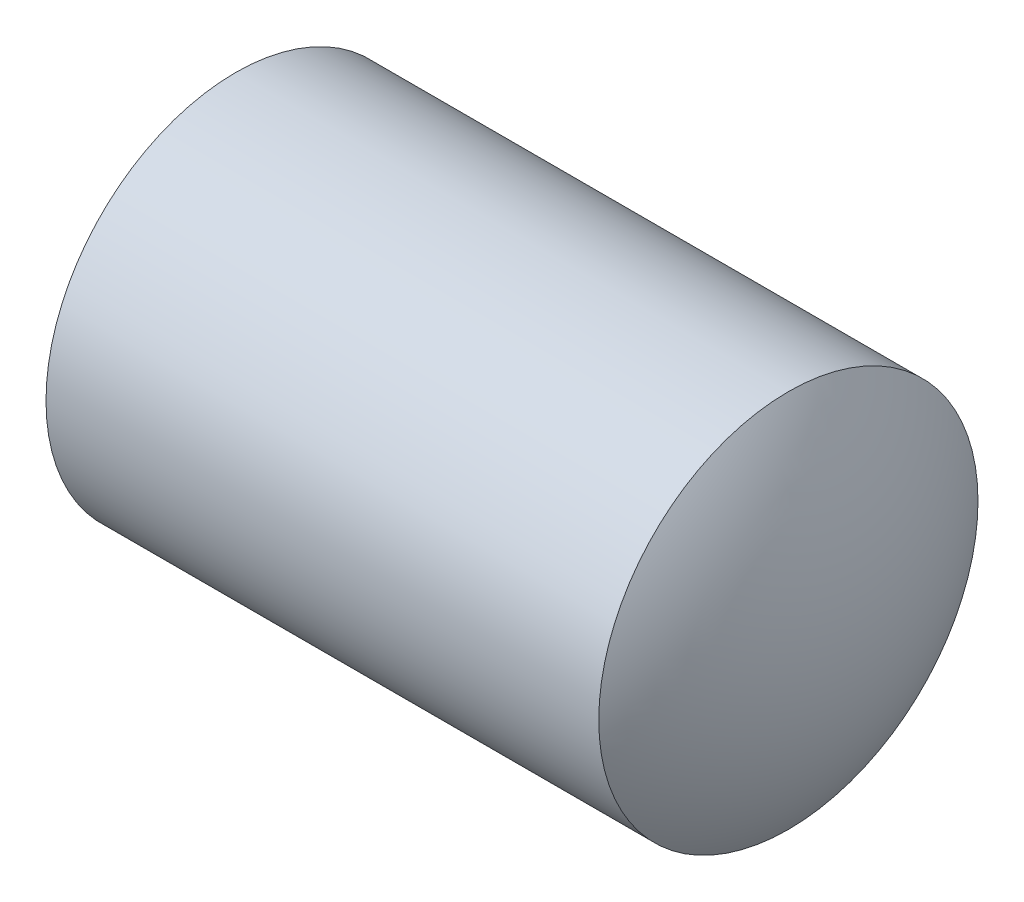
ISO-10303-21;
HEADER;
FILE_DESCRIPTION(('STEP AP214'),'2;1');
FILE_NAME('part.step','',(''),(''),'','','');
FILE_SCHEMA(('AUTOMOTIVE_DESIGN { 1 0 10303 214 1 1 1 1 }'));
ENDSEC;
DATA;
#1=APPLICATION_CONTEXT('core data for automotive mechanical design processes');
#2=APPLICATION_PROTOCOL_DEFINITION('international standard','automotive_design',2000,#1);
#3=PRODUCT_CONTEXT('',#1,'mechanical');
#4=PRODUCT('Part','Part','',(#3));
#5=PRODUCT_RELATED_PRODUCT_CATEGORY('part','',(#4));
#6=PRODUCT_DEFINITION_FORMATION('','',#4);
#7=PRODUCT_DEFINITION_CONTEXT('part definition',#1,'design');
#8=PRODUCT_DEFINITION('design','',#6,#7);
#9=PRODUCT_DEFINITION_SHAPE('','',#8);
#10=(LENGTH_UNIT() NAMED_UNIT(*) SI_UNIT(.MILLI.,.METRE.));
#11=(NAMED_UNIT(*) PLANE_ANGLE_UNIT() SI_UNIT($,.RADIAN.));
#12=(NAMED_UNIT(*) SI_UNIT($,.STERADIAN.) SOLID_ANGLE_UNIT());
#13=UNCERTAINTY_MEASURE_WITH_UNIT(LENGTH_MEASURE(1.E-05),#10,'distance_accuracy_value','');
#14=(GEOMETRIC_REPRESENTATION_CONTEXT(3) GLOBAL_UNCERTAINTY_ASSIGNED_CONTEXT((#13)) GLOBAL_UNIT_ASSIGNED_CONTEXT((#10,
#11,#12)) REPRESENTATION_CONTEXT('',''));
#15=CARTESIAN_POINT('',(0.,0.,0.));
#16=DIRECTION('',(0.,0.,1.));
#17=DIRECTION('',(1.,0.,0.));
#18=AXIS2_PLACEMENT_3D('',#15,#16,#17);
#19=CARTESIAN_POINT('',(0.,0.,0.));
#20=DIRECTION('',(-1.,0.,0.));
#21=DIRECTION('',(0.,0.,1.));
#22=AXIS2_PLACEMENT_3D('',#19,#20,#21);
#23=PLANE('',#22);
#24=CARTESIAN_POINT('',(0.,0.,0.));
#25=DIRECTION('',(-1.,0.,0.));
#26=DIRECTION('',(0.,0.,1.));
#27=AXIS2_PLACEMENT_3D('',#24,#25,#26);
#28=CIRCLE('',#27,1.2195);
#29=CARTESIAN_POINT('',(0.,0.,1.2195));
#30=VERTEX_POINT('',#29);
#31=EDGE_CURVE('E137',#30,#30,#28,.T.);
#32=ORIENTED_EDGE('',*,*,#31,.T.);
#33=EDGE_LOOP('',(#32));
#34=FACE_BOUND('',#33,.T.);
#35=DIRECTION('',(0.,0.,-1.));
#36=VECTOR('',#35,1.);
#37=CARTESIAN_POINT('',(0.,0.750000000000004,0.43301270189222));
#38=LINE('',#37,#36);
#39=CARTESIAN_POINT('',(0.,0.750000000000004,0.43301270189222));
#40=VERTEX_POINT('',#39);
#41=CARTESIAN_POINT('',(0.,0.750000000000003,-0.433012701892218));
#42=VERTEX_POINT('',#41);
#43=EDGE_CURVE('E128',#40,#42,#38,.T.);
#44=ORIENTED_EDGE('',*,*,#43,.F.);
#45=DIRECTION('',(0.,-0.866025403784438,0.500000000000001));
#46=VECTOR('',#45,1.);
#47=CARTESIAN_POINT('',(0.,0.750000000000004,0.43301270189222));
#48=LINE('',#47,#46);
#49=CARTESIAN_POINT('',(0.,0.,0.86602540378444));
#50=VERTEX_POINT('',#49);
#51=EDGE_CURVE('E50',#40,#50,#48,.T.);
#52=ORIENTED_EDGE('',*,*,#51,.T.);
#53=DIRECTION('',(0.,0.866025403784439,0.5));
#54=VECTOR('',#53,1.);
#55=CARTESIAN_POINT('',(0.,-0.749999999999996,0.433012701892221));
#56=LINE('',#55,#54);
#57=CARTESIAN_POINT('',(0.,-0.749999999999996,0.433012701892221));
#58=VERTEX_POINT('',#57);
#59=EDGE_CURVE('E119',#58,#50,#56,.T.);
#60=ORIENTED_EDGE('',*,*,#59,.F.);
#61=DIRECTION('',(0.,0.,-1.));
#62=VECTOR('',#61,1.);
#63=CARTESIAN_POINT('',(0.,-0.749999999999996,0.433012701892221));
#64=LINE('',#63,#62);
#65=CARTESIAN_POINT('',(0.,-0.749999999999996,-0.433012701892218));
#66=VERTEX_POINT('',#65);
#67=EDGE_CURVE('E122',#58,#66,#64,.T.);
#68=ORIENTED_EDGE('',*,*,#67,.T.);
#69=DIRECTION('',(0.,0.866025403784438,-0.500000000000001));
#70=VECTOR('',#69,1.);
#71=CARTESIAN_POINT('',(0.,-0.749999999999996,-0.433012701892218));
#72=LINE('',#71,#70);
#73=CARTESIAN_POINT('',(0.,0.,-0.866025403784438));
#74=VERTEX_POINT('',#73);
#75=EDGE_CURVE('E125',#66,#74,#72,.T.);
#76=ORIENTED_EDGE('',*,*,#75,.T.);
#77=DIRECTION('',(0.,-0.866025403784439,-0.5));
#78=VECTOR('',#77,1.);
#79=CARTESIAN_POINT('',(0.,0.750000000000003,-0.433012701892218));
#80=LINE('',#79,#78);
#81=EDGE_CURVE('E108',#42,#74,#80,.T.);
#82=ORIENTED_EDGE('',*,*,#81,.F.);
#83=EDGE_LOOP('',(#44,#52,#60,#68,#76,#82));
#84=FACE_BOUND('',#83,.T.);
#85=ADVANCED_FACE('F35',(#34,#84),#23,.T.);
#86=CARTESIAN_POINT('',(2.35,0.,0.));
#87=DIRECTION('',(-1.,0.,0.));
#88=DIRECTION('',(0.,1.,0.));
#89=AXIS2_PLACEMENT_3D('',#86,#87,#88);
#90=SPHERICAL_SURFACE('',#89,2.65);
#91=CARTESIAN_POINT('',(4.53460522749535,0.,0.));
#92=DIRECTION('',(-1.,0.,0.));
#93=DIRECTION('',(0.,0.,1.));
#94=AXIS2_PLACEMENT_3D('',#91,#92,#93);
#95=CIRCLE('',#94,1.5);
#96=CARTESIAN_POINT('',(4.53460522749535,0.,1.5));
#97=VERTEX_POINT('',#96);
#98=EDGE_CURVE('E11',#97,#97,#95,.T.);
#99=ORIENTED_EDGE('',*,*,#98,.F.);
#100=EDGE_LOOP('',(#99));
#101=FACE_BOUND('',#100,.T.);
#102=ADVANCED_FACE('F37',(#101),#90,.T.);
#103=CARTESIAN_POINT('',(-12.7,0.,0.));
#104=DIRECTION('',(-1.,0.,0.));
#105=DIRECTION('',(0.,0.,1.));
#106=AXIS2_PLACEMENT_3D('',#103,#104,#105);
#107=CYLINDRICAL_SURFACE('',#106,1.5);
#108=ORIENTED_EDGE('',*,*,#98,.T.);
#109=EDGE_LOOP('',(#108));
#110=FACE_BOUND('',#109,.T.);
#111=CARTESIAN_POINT('',(0.161946750507689,0.,0.));
#112=DIRECTION('',(-1.,0.,0.));
#113=DIRECTION('',(0.,0.,1.));
#114=AXIS2_PLACEMENT_3D('',#111,#112,#113);
#115=CIRCLE('',#114,1.5);
#116=CARTESIAN_POINT('',(0.161946750507689,0.,1.5));
#117=VERTEX_POINT('',#116);
#118=EDGE_CURVE('E43',#117,#117,#115,.T.);
#119=ORIENTED_EDGE('',*,*,#118,.F.);
#120=EDGE_LOOP('',(#119));
#121=FACE_BOUND('',#120,.T.);
#122=ADVANCED_FACE('F145',(#110,#121),#107,.T.);
#123=CARTESIAN_POINT('',(0.,0.,0.));
#124=DIRECTION('',(1.,0.,0.));
#125=DIRECTION('',(0.,0.,-1.));
#126=AXIS2_PLACEMENT_3D('',#123,#124,#125);
#127=CONICAL_SURFACE('',#126,1.2195,1.0471975511966);
#128=ORIENTED_EDGE('',*,*,#118,.T.);
#129=EDGE_LOOP('',(#128));
#130=FACE_BOUND('',#129,.T.);
#131=ORIENTED_EDGE('',*,*,#31,.F.);
#132=EDGE_LOOP('',(#131));
#133=FACE_BOUND('',#132,.T.);
#134=ADVANCED_FACE('F142',(#130,#133),#127,.T.);
#135=CARTESIAN_POINT('',(2.1,0.750000000000004,0.43301270189222));
#136=DIRECTION('',(0.,-0.500000000000001,-0.866025403784438));
#137=DIRECTION('',(0.,0.866025403784438,-0.500000000000001));
#138=AXIS2_PLACEMENT_3D('',#135,#136,#137);
#139=PLANE('',#138);
#140=ORIENTED_EDGE('',*,*,#51,.F.);
#141=DIRECTION('',(-1.,0.,0.));
#142=VECTOR('',#141,1.);
#143=CARTESIAN_POINT('',(2.1,0.750000000000004,0.43301270189222));
#144=LINE('',#143,#142);
#145=CARTESIAN_POINT('',(2.1,0.750000000000004,0.43301270189222));
#146=VERTEX_POINT('',#145);
#147=EDGE_CURVE('E55',#146,#40,#144,.T.);
#148=ORIENTED_EDGE('',*,*,#147,.F.);
#149=DIRECTION('',(0.,-0.866025403784438,0.500000000000001));
#150=VECTOR('',#149,1.);
#151=CARTESIAN_POINT('',(2.1,0.750000000000004,0.43301270189222));
#152=LINE('',#151,#150);
#153=CARTESIAN_POINT('',(2.1,0.,0.86602540378444));
#154=VERTEX_POINT('',#153);
#155=EDGE_CURVE('E82',#146,#154,#152,.T.);
#156=ORIENTED_EDGE('',*,*,#155,.T.);
#157=DIRECTION('',(-1.,0.,0.));
#158=VECTOR('',#157,1.);
#159=CARTESIAN_POINT('',(2.1,0.,0.86602540378444));
#160=LINE('',#159,#158);
#161=EDGE_CURVE('E135',#154,#50,#160,.T.);
#162=ORIENTED_EDGE('',*,*,#161,.T.);
#163=EDGE_LOOP('',(#140,#148,#156,#162));
#164=FACE_BOUND('',#163,.T.);
#165=ADVANCED_FACE('F152',(#164),#139,.T.);
#166=CARTESIAN_POINT('',(2.1,-0.749999999999996,0.433012701892221));
#167=DIRECTION('',(0.,-0.5,0.866025403784439));
#168=DIRECTION('',(0.,-0.866025403784439,-0.5));
#169=AXIS2_PLACEMENT_3D('',#166,#167,#168);
#170=PLANE('',#169);
#171=ORIENTED_EDGE('',*,*,#59,.T.);
#172=ORIENTED_EDGE('',*,*,#161,.F.);
#173=DIRECTION('',(0.,0.866025403784439,0.5));
#174=VECTOR('',#173,1.);
#175=CARTESIAN_POINT('',(2.1,-0.749999999999996,0.433012701892221));
#176=LINE('',#175,#174);
#177=CARTESIAN_POINT('',(2.1,-0.749999999999996,0.433012701892221));
#178=VERTEX_POINT('',#177);
#179=EDGE_CURVE('E250',#178,#154,#176,.T.);
#180=ORIENTED_EDGE('',*,*,#179,.F.);
#181=DIRECTION('',(-1.,0.,0.));
#182=VECTOR('',#181,1.);
#183=CARTESIAN_POINT('',(2.1,-0.749999999999996,0.433012701892221));
#184=LINE('',#183,#182);
#185=EDGE_CURVE('E133',#178,#58,#184,.T.);
#186=ORIENTED_EDGE('',*,*,#185,.T.);
#187=EDGE_LOOP('',(#171,#172,#180,#186));
#188=FACE_BOUND('',#187,.T.);
#189=ADVANCED_FACE('F164',(#188),#170,.F.);
#190=CARTESIAN_POINT('',(2.1,-0.749999999999996,0.433012701892221));
#191=DIRECTION('',(0.,1.,0.));
#192=DIRECTION('',(0.,0.,1.));
#193=AXIS2_PLACEMENT_3D('',#190,#191,#192);
#194=PLANE('',#193);
#195=ORIENTED_EDGE('',*,*,#67,.F.);
#196=ORIENTED_EDGE('',*,*,#185,.F.);
#197=DIRECTION('',(0.,0.,-1.));
#198=VECTOR('',#197,1.);
#199=CARTESIAN_POINT('',(2.1,-0.749999999999996,0.433012701892221));
#200=LINE('',#199,#198);
#201=CARTESIAN_POINT('',(2.1,-0.749999999999996,-0.433012701892218));
#202=VERTEX_POINT('',#201);
#203=EDGE_CURVE('E103',#178,#202,#200,.T.);
#204=ORIENTED_EDGE('',*,*,#203,.T.);
#205=DIRECTION('',(-1.,0.,0.));
#206=VECTOR('',#205,1.);
#207=CARTESIAN_POINT('',(2.1,-0.749999999999996,-0.433012701892218));
#208=LINE('',#207,#206);
#209=EDGE_CURVE('E98',#202,#66,#208,.T.);
#210=ORIENTED_EDGE('',*,*,#209,.T.);
#211=EDGE_LOOP('',(#195,#196,#204,#210));
#212=FACE_BOUND('',#211,.T.);
#213=ADVANCED_FACE('F167',(#212),#194,.T.);
#214=CARTESIAN_POINT('',(2.1,-0.749999999999996,-0.433012701892218));
#215=DIRECTION('',(0.,0.500000000000001,0.866025403784438));
#216=DIRECTION('',(0.,-0.866025403784438,0.500000000000001));
#217=AXIS2_PLACEMENT_3D('',#214,#215,#216);
#218=PLANE('',#217);
#219=ORIENTED_EDGE('',*,*,#75,.F.);
#220=ORIENTED_EDGE('',*,*,#209,.F.);
#221=DIRECTION('',(0.,0.866025403784438,-0.500000000000001));
#222=VECTOR('',#221,1.);
#223=CARTESIAN_POINT('',(2.1,-0.749999999999996,-0.433012701892218));
#224=LINE('',#223,#222);
#225=CARTESIAN_POINT('',(2.1,0.,-0.866025403784438));
#226=VERTEX_POINT('',#225);
#227=EDGE_CURVE('E93',#202,#226,#224,.T.);
#228=ORIENTED_EDGE('',*,*,#227,.T.);
#229=DIRECTION('',(-1.,0.,0.));
#230=VECTOR('',#229,1.);
#231=CARTESIAN_POINT('',(2.1,0.,-0.866025403784438));
#232=LINE('',#231,#230);
#233=EDGE_CURVE('E97',#226,#74,#232,.T.);
#234=ORIENTED_EDGE('',*,*,#233,.T.);
#235=EDGE_LOOP('',(#219,#220,#228,#234));
#236=FACE_BOUND('',#235,.T.);
#237=ADVANCED_FACE('F96',(#236),#218,.T.);
#238=CARTESIAN_POINT('',(2.1,0.750000000000003,-0.433012701892218));
#239=DIRECTION('',(0.,0.5,-0.866025403784439));
#240=DIRECTION('',(0.,0.866025403784439,0.5));
#241=AXIS2_PLACEMENT_3D('',#238,#239,#240);
#242=PLANE('',#241);
#243=ORIENTED_EDGE('',*,*,#81,.T.);
#244=ORIENTED_EDGE('',*,*,#233,.F.);
#245=DIRECTION('',(0.,-0.866025403784439,-0.5));
#246=VECTOR('',#245,1.);
#247=CARTESIAN_POINT('',(2.1,0.750000000000003,-0.433012701892218));
#248=LINE('',#247,#246);
#249=CARTESIAN_POINT('',(2.1,0.750000000000003,-0.433012701892218));
#250=VERTEX_POINT('',#249);
#251=EDGE_CURVE('E102',#250,#226,#248,.T.);
#252=ORIENTED_EDGE('',*,*,#251,.F.);
#253=DIRECTION('',(-1.,0.,0.));
#254=VECTOR('',#253,1.);
#255=CARTESIAN_POINT('',(2.1,0.750000000000003,-0.433012701892218));
#256=LINE('',#255,#254);
#257=EDGE_CURVE('E78',#250,#42,#256,.T.);
#258=ORIENTED_EDGE('',*,*,#257,.T.);
#259=EDGE_LOOP('',(#243,#244,#252,#258));
#260=FACE_BOUND('',#259,.T.);
#261=ADVANCED_FACE('F105',(#260),#242,.F.);
#262=CARTESIAN_POINT('',(2.1,0.750000000000004,0.43301270189222));
#263=DIRECTION('',(0.,1.,0.));
#264=DIRECTION('',(0.,0.,1.));
#265=AXIS2_PLACEMENT_3D('',#262,#263,#264);
#266=PLANE('',#265);
#267=ORIENTED_EDGE('',*,*,#43,.T.);
#268=ORIENTED_EDGE('',*,*,#257,.F.);
#269=DIRECTION('',(0.,0.,-1.));
#270=VECTOR('',#269,1.);
#271=CARTESIAN_POINT('',(2.1,0.750000000000004,0.43301270189222));
#272=LINE('',#271,#270);
#273=EDGE_CURVE('E113',#146,#250,#272,.T.);
#274=ORIENTED_EDGE('',*,*,#273,.F.);
#275=ORIENTED_EDGE('',*,*,#147,.T.);
#276=EDGE_LOOP('',(#267,#268,#274,#275));
#277=FACE_BOUND('',#276,.T.);
#278=ADVANCED_FACE('F176',(#277),#266,.F.);
#279=CARTESIAN_POINT('',(2.1,0.,0.86602540378444));
#280=DIRECTION('',(-1.,0.,0.));
#281=DIRECTION('',(0.,0.,1.));
#282=AXIS2_PLACEMENT_3D('',#279,#280,#281);
#283=PLANE('',#282);
#284=ORIENTED_EDGE('',*,*,#155,.F.);
#285=ORIENTED_EDGE('',*,*,#273,.T.);
#286=ORIENTED_EDGE('',*,*,#251,.T.);
#287=ORIENTED_EDGE('',*,*,#227,.F.);
#288=ORIENTED_EDGE('',*,*,#203,.F.);
#289=ORIENTED_EDGE('',*,*,#179,.T.);
#290=EDGE_LOOP('',(#284,#285,#286,#287,#288,#289));
#291=FACE_BOUND('',#290,.T.);
#292=ADVANCED_FACE('F111',(#291),#283,.T.);
#293=CLOSED_SHELL('',(#85,#102,#122,#134,#165,#189,#213,#237,#261,#278,#292));
#294=MANIFOLD_SOLID_BREP('B2',#293);
#295=ADVANCED_BREP_SHAPE_REPRESENTATION('',(#18,#294),#14);
#296=SHAPE_DEFINITION_REPRESENTATION(#9,#295);
ENDSEC;
END-ISO-10303-21;
